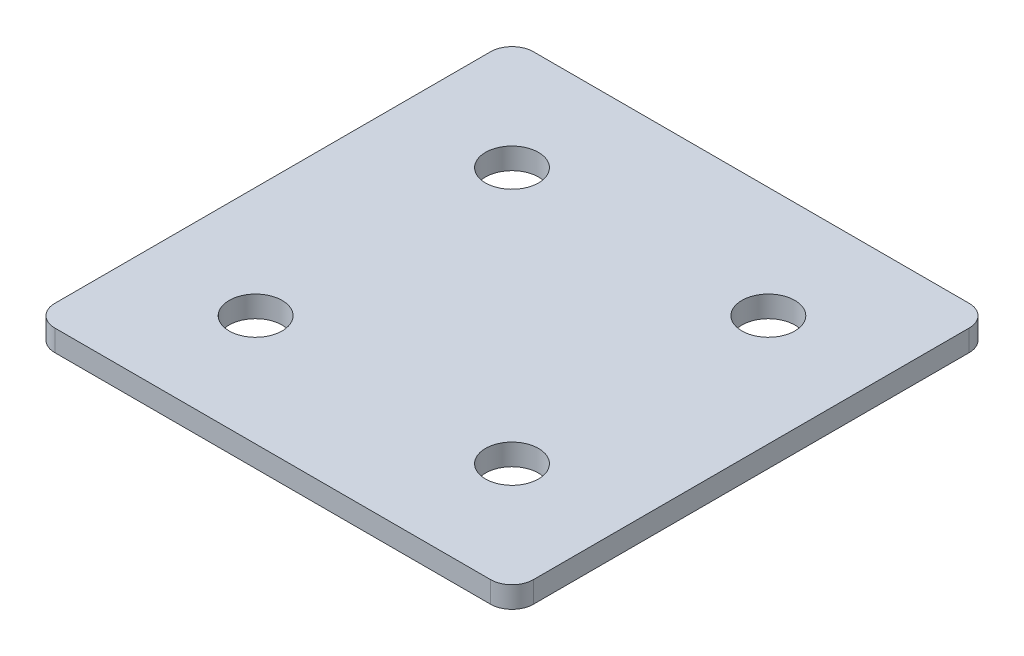
ISO-10303-21;
HEADER;
FILE_DESCRIPTION(('STEP AP214'),'2;1');
FILE_NAME('part.step','',(''),(''),'','','');
FILE_SCHEMA(('AUTOMOTIVE_DESIGN { 1 0 10303 214 1 1 1 1 }'));
ENDSEC;
DATA;
#1=APPLICATION_CONTEXT('core data for automotive mechanical design processes');
#2=APPLICATION_PROTOCOL_DEFINITION('international standard','automotive_design',2000,#1);
#3=PRODUCT_CONTEXT('',#1,'mechanical');
#4=PRODUCT('Part','Part','',(#3));
#5=PRODUCT_RELATED_PRODUCT_CATEGORY('part','',(#4));
#6=PRODUCT_DEFINITION_FORMATION('','',#4);
#7=PRODUCT_DEFINITION_CONTEXT('part definition',#1,'design');
#8=PRODUCT_DEFINITION('design','',#6,#7);
#9=PRODUCT_DEFINITION_SHAPE('','',#8);
#10=(LENGTH_UNIT() NAMED_UNIT(*) SI_UNIT(.MILLI.,.METRE.));
#11=(NAMED_UNIT(*) PLANE_ANGLE_UNIT() SI_UNIT($,.RADIAN.));
#12=(NAMED_UNIT(*) SI_UNIT($,.STERADIAN.) SOLID_ANGLE_UNIT());
#13=UNCERTAINTY_MEASURE_WITH_UNIT(LENGTH_MEASURE(1.E-05),#10,'distance_accuracy_value','');
#14=(GEOMETRIC_REPRESENTATION_CONTEXT(3) GLOBAL_UNCERTAINTY_ASSIGNED_CONTEXT((#13)) GLOBAL_UNIT_ASSIGNED_CONTEXT((#10,
#11,#12)) REPRESENTATION_CONTEXT('',''));
#15=CARTESIAN_POINT('',(0.,0.,0.));
#16=DIRECTION('',(0.,0.,1.));
#17=DIRECTION('',(1.,0.,0.));
#18=AXIS2_PLACEMENT_3D('',#15,#16,#17);
#19=CARTESIAN_POINT('',(-2.26192967289762,2.32454322778494,-16.3120326384523));
#20=DIRECTION('',(0.,-1.,0.));
#21=DIRECTION('',(0.,0.,-1.));
#22=AXIS2_PLACEMENT_3D('',#19,#20,#21);
#23=PLANE('',#22);
#24=CARTESIAN_POINT('',(12.7380703271024,2.32454322778494,13.6879673615477));
#25=DIRECTION('',(0.,1.,0.));
#26=DIRECTION('',(0.,0.,1.));
#27=AXIS2_PLACEMENT_3D('',#24,#25,#26);
#28=CIRCLE('',#27,3.1);
#29=CARTESIAN_POINT('',(12.7380703271024,2.32454322778494,16.7879673615477));
#30=VERTEX_POINT('',#29);
#31=EDGE_CURVE('E165',#30,#30,#28,.T.);
#32=ORIENTED_EDGE('',*,*,#31,.T.);
#33=EDGE_LOOP('',(#32));
#34=FACE_BOUND('',#33,.T.);
#35=CARTESIAN_POINT('',(-17.2619296728977,2.32454322778494,13.6879673615477));
#36=DIRECTION('',(0.,1.,0.));
#37=DIRECTION('',(0.,0.,1.));
#38=AXIS2_PLACEMENT_3D('',#35,#36,#37);
#39=CIRCLE('',#38,3.1);
#40=CARTESIAN_POINT('',(-17.2619296728977,2.32454322778494,16.7879673615477));
#41=VERTEX_POINT('',#40);
#42=EDGE_CURVE('E159',#41,#41,#39,.T.);
#43=ORIENTED_EDGE('',*,*,#42,.T.);
#44=EDGE_LOOP('',(#43));
#45=FACE_BOUND('',#44,.T.);
#46=CARTESIAN_POINT('',(12.7380703271024,2.32454322778494,-16.3120326384523));
#47=DIRECTION('',(0.,1.,0.));
#48=DIRECTION('',(0.,0.,1.));
#49=AXIS2_PLACEMENT_3D('',#46,#47,#48);
#50=CIRCLE('',#49,3.1);
#51=CARTESIAN_POINT('',(12.7380703271024,2.32454322778494,-13.2120326384523));
#52=VERTEX_POINT('',#51);
#53=EDGE_CURVE('E154',#52,#52,#50,.T.);
#54=ORIENTED_EDGE('',*,*,#53,.T.);
#55=EDGE_LOOP('',(#54));
#56=FACE_BOUND('',#55,.T.);
#57=CARTESIAN_POINT('',(-17.2619296728977,2.32454322778494,-16.3120326384523));
#58=DIRECTION('',(0.,1.,0.));
#59=DIRECTION('',(0.,0.,1.));
#60=AXIS2_PLACEMENT_3D('',#57,#58,#59);
#61=CIRCLE('',#60,3.1);
#62=CARTESIAN_POINT('',(-17.2619296728977,2.32454322778494,-13.2120326384523));
#63=VERTEX_POINT('',#62);
#64=EDGE_CURVE('E147',#63,#63,#61,.T.);
#65=ORIENTED_EDGE('',*,*,#64,.T.);
#66=EDGE_LOOP('',(#65));
#67=FACE_BOUND('',#66,.T.);
#68=DIRECTION('',(0.,0.,-1.));
#69=VECTOR('',#68,1.);
#70=CARTESIAN_POINT('',(25.7380703271025,2.32454322778494,26.6879673615476));
#71=LINE('',#70,#69);
#72=CARTESIAN_POINT('',(25.7380703271025,2.32454322778494,24.1879673615476));
#73=VERTEX_POINT('',#72);
#74=CARTESIAN_POINT('',(25.7380703271025,2.32454322778494,-26.8120326384524));
#75=VERTEX_POINT('',#74);
#76=EDGE_CURVE('E106',#73,#75,#71,.T.);
#77=ORIENTED_EDGE('',*,*,#76,.F.);
#78=CARTESIAN_POINT('',(23.2380703271025,2.32454322778494,24.1879673615476));
#79=DIRECTION('',(0.,-1.,0.));
#80=DIRECTION('',(0.,0.,-1.));
#81=AXIS2_PLACEMENT_3D('',#78,#79,#80);
#82=CIRCLE('',#81,2.5);
#83=CARTESIAN_POINT('',(23.2380703271025,2.32454322778494,26.6879673615476));
#84=VERTEX_POINT('',#83);
#85=EDGE_CURVE('E128',#73,#84,#82,.T.);
#86=ORIENTED_EDGE('',*,*,#85,.T.);
#87=DIRECTION('',(1.,0.,0.));
#88=VECTOR('',#87,1.);
#89=CARTESIAN_POINT('',(-30.2619296728977,2.32454322778494,26.6879673615476));
#90=LINE('',#89,#88);
#91=CARTESIAN_POINT('',(-27.7619296728977,2.32454322778494,26.6879673615476));
#92=VERTEX_POINT('',#91);
#93=EDGE_CURVE('E110',#92,#84,#90,.T.);
#94=ORIENTED_EDGE('',*,*,#93,.F.);
#95=CARTESIAN_POINT('',(-27.7619296728977,2.32454322778494,24.1879673615476));
#96=DIRECTION('',(0.,-1.,0.));
#97=DIRECTION('',(0.,0.,-1.));
#98=AXIS2_PLACEMENT_3D('',#95,#96,#97);
#99=CIRCLE('',#98,2.5);
#100=CARTESIAN_POINT('',(-30.2619296728977,2.32454322778494,24.1879673615476));
#101=VERTEX_POINT('',#100);
#102=EDGE_CURVE('E105',#92,#101,#99,.T.);
#103=ORIENTED_EDGE('',*,*,#102,.T.);
#104=DIRECTION('',(0.,0.,1.));
#105=VECTOR('',#104,1.);
#106=CARTESIAN_POINT('',(-30.2619296728977,2.32454322778494,-29.3120326384524));
#107=LINE('',#106,#105);
#108=CARTESIAN_POINT('',(-30.2619296728977,2.32454322778494,-26.8120326384524));
#109=VERTEX_POINT('',#108);
#110=EDGE_CURVE('E137',#109,#101,#107,.T.);
#111=ORIENTED_EDGE('',*,*,#110,.F.);
#112=CARTESIAN_POINT('',(-27.7619296728977,2.32454322778494,-26.8120326384524));
#113=DIRECTION('',(0.,-1.,0.));
#114=DIRECTION('',(0.,0.,-1.));
#115=AXIS2_PLACEMENT_3D('',#112,#113,#114);
#116=CIRCLE('',#115,2.5);
#117=CARTESIAN_POINT('',(-27.7619296728977,2.32454322778494,-29.3120326384524));
#118=VERTEX_POINT('',#117);
#119=EDGE_CURVE('E31',#109,#118,#116,.T.);
#120=ORIENTED_EDGE('',*,*,#119,.T.);
#121=DIRECTION('',(-1.,0.,0.));
#122=VECTOR('',#121,1.);
#123=CARTESIAN_POINT('',(25.7380703271025,2.32454322778494,-29.3120326384524));
#124=LINE('',#123,#122);
#125=CARTESIAN_POINT('',(23.2380703271025,2.32454322778494,-29.3120326384524));
#126=VERTEX_POINT('',#125);
#127=EDGE_CURVE('E138',#126,#118,#124,.T.);
#128=ORIENTED_EDGE('',*,*,#127,.F.);
#129=CARTESIAN_POINT('',(23.2380703271025,2.32454322778494,-26.8120326384524));
#130=DIRECTION('',(0.,-1.,0.));
#131=DIRECTION('',(0.,0.,-1.));
#132=AXIS2_PLACEMENT_3D('',#129,#130,#131);
#133=CIRCLE('',#132,2.5);
#134=EDGE_CURVE('E126',#126,#75,#133,.T.);
#135=ORIENTED_EDGE('',*,*,#134,.T.);
#136=EDGE_LOOP('',(#77,#86,#94,#103,#111,#120,#128,#135));
#137=FACE_BOUND('',#136,.T.);
#138=ADVANCED_FACE('F16',(#34,#45,#56,#67,#137),#23,.T.);
#139=CARTESIAN_POINT('',(25.7380703271025,2.32454322778494,-29.3120326384524));
#140=DIRECTION('',(0.,0.,-1.));
#141=DIRECTION('',(-1.,0.,0.));
#142=AXIS2_PLACEMENT_3D('',#139,#140,#141);
#143=PLANE('',#142);
#144=DIRECTION('',(-1.,0.,0.));
#145=VECTOR('',#144,1.);
#146=CARTESIAN_POINT('',(25.7380703271025,4.82454322778494,-29.3120326384524));
#147=LINE('',#146,#145);
#148=CARTESIAN_POINT('',(23.2380703271025,4.82454322778494,-29.3120326384524));
#149=VERTEX_POINT('',#148);
#150=CARTESIAN_POINT('',(-27.7619296728977,4.82454322778494,-29.3120326384524));
#151=VERTEX_POINT('',#150);
#152=EDGE_CURVE('E144',#149,#151,#147,.T.);
#153=ORIENTED_EDGE('',*,*,#152,.F.);
#154=DIRECTION('',(0.,1.,0.));
#155=VECTOR('',#154,1.);
#156=CARTESIAN_POINT('',(23.2380703271025,2.32454322778494,-29.3120326384524));
#157=LINE('',#156,#155);
#158=EDGE_CURVE('E38',#149,#126,#157,.F.);
#159=ORIENTED_EDGE('',*,*,#158,.T.);
#160=ORIENTED_EDGE('',*,*,#127,.T.);
#161=DIRECTION('',(0.,1.,0.));
#162=VECTOR('',#161,1.);
#163=CARTESIAN_POINT('',(-27.7619296728977,2.32454322778494,-29.3120326384524));
#164=LINE('',#163,#162);
#165=EDGE_CURVE('E130',#118,#151,#164,.T.);
#166=ORIENTED_EDGE('',*,*,#165,.T.);
#167=EDGE_LOOP('',(#153,#159,#160,#166));
#168=FACE_BOUND('',#167,.T.);
#169=ADVANCED_FACE('F206',(#168),#143,.T.);
#170=CARTESIAN_POINT('',(25.7380703271025,2.32454322778494,26.6879673615476));
#171=DIRECTION('',(1.,0.,0.));
#172=DIRECTION('',(0.,0.,-1.));
#173=AXIS2_PLACEMENT_3D('',#170,#171,#172);
#174=PLANE('',#173);
#175=DIRECTION('',(0.,0.,-1.));
#176=VECTOR('',#175,1.);
#177=CARTESIAN_POINT('',(25.7380703271025,4.82454322778494,26.6879673615476));
#178=LINE('',#177,#176);
#179=CARTESIAN_POINT('',(25.7380703271025,4.82454322778494,24.1879673615476));
#180=VERTEX_POINT('',#179);
#181=CARTESIAN_POINT('',(25.7380703271025,4.82454322778494,-26.8120326384524));
#182=VERTEX_POINT('',#181);
#183=EDGE_CURVE('E102',#180,#182,#178,.T.);
#184=ORIENTED_EDGE('',*,*,#183,.F.);
#185=DIRECTION('',(0.,1.,0.));
#186=VECTOR('',#185,1.);
#187=CARTESIAN_POINT('',(25.7380703271025,2.32454322778494,24.1879673615476));
#188=LINE('',#187,#186);
#189=EDGE_CURVE('E122',#180,#73,#188,.F.);
#190=ORIENTED_EDGE('',*,*,#189,.T.);
#191=ORIENTED_EDGE('',*,*,#76,.T.);
#192=DIRECTION('',(0.,1.,0.));
#193=VECTOR('',#192,1.);
#194=CARTESIAN_POINT('',(25.7380703271025,2.32454322778494,-26.8120326384524));
#195=LINE('',#194,#193);
#196=EDGE_CURVE('E119',#75,#182,#195,.T.);
#197=ORIENTED_EDGE('',*,*,#196,.T.);
#198=EDGE_LOOP('',(#184,#190,#191,#197));
#199=FACE_BOUND('',#198,.T.);
#200=ADVANCED_FACE('F211',(#199),#174,.T.);
#201=CARTESIAN_POINT('',(-30.2619296728977,2.32454322778494,26.6879673615476));
#202=DIRECTION('',(0.,0.,1.));
#203=DIRECTION('',(1.,0.,0.));
#204=AXIS2_PLACEMENT_3D('',#201,#202,#203);
#205=PLANE('',#204);
#206=ORIENTED_EDGE('',*,*,#93,.T.);
#207=DIRECTION('',(0.,1.,0.));
#208=VECTOR('',#207,1.);
#209=CARTESIAN_POINT('',(23.2380703271025,2.32454322778494,26.6879673615476));
#210=LINE('',#209,#208);
#211=CARTESIAN_POINT('',(23.2380703271025,4.82454322778494,26.6879673615476));
#212=VERTEX_POINT('',#211);
#213=EDGE_CURVE('E93',#84,#212,#210,.T.);
#214=ORIENTED_EDGE('',*,*,#213,.T.);
#215=DIRECTION('',(1.,0.,0.));
#216=VECTOR('',#215,1.);
#217=CARTESIAN_POINT('',(-30.2619296728977,4.82454322778494,26.6879673615476));
#218=LINE('',#217,#216);
#219=CARTESIAN_POINT('',(-27.7619296728977,4.82454322778494,26.6879673615476));
#220=VERTEX_POINT('',#219);
#221=EDGE_CURVE('E85',#220,#212,#218,.T.);
#222=ORIENTED_EDGE('',*,*,#221,.F.);
#223=DIRECTION('',(0.,1.,0.));
#224=VECTOR('',#223,1.);
#225=CARTESIAN_POINT('',(-27.7619296728977,2.32454322778494,26.6879673615476));
#226=LINE('',#225,#224);
#227=EDGE_CURVE('E99',#220,#92,#226,.F.);
#228=ORIENTED_EDGE('',*,*,#227,.T.);
#229=EDGE_LOOP('',(#206,#214,#222,#228));
#230=FACE_BOUND('',#229,.T.);
#231=ADVANCED_FACE('F98',(#230),#205,.T.);
#232=CARTESIAN_POINT('',(-30.2619296728977,2.32454322778494,-29.3120326384524));
#233=DIRECTION('',(-1.,0.,0.));
#234=DIRECTION('',(0.,0.,1.));
#235=AXIS2_PLACEMENT_3D('',#232,#233,#234);
#236=PLANE('',#235);
#237=DIRECTION('',(0.,0.,1.));
#238=VECTOR('',#237,1.);
#239=CARTESIAN_POINT('',(-30.2619296728977,4.82454322778494,-29.3120326384524));
#240=LINE('',#239,#238);
#241=CARTESIAN_POINT('',(-30.2619296728977,4.82454322778494,-26.8120326384524));
#242=VERTEX_POINT('',#241);
#243=CARTESIAN_POINT('',(-30.2619296728977,4.82454322778494,24.1879673615476));
#244=VERTEX_POINT('',#243);
#245=EDGE_CURVE('E87',#242,#244,#240,.T.);
#246=ORIENTED_EDGE('',*,*,#245,.F.);
#247=DIRECTION('',(0.,1.,0.));
#248=VECTOR('',#247,1.);
#249=CARTESIAN_POINT('',(-30.2619296728977,2.32454322778494,-26.8120326384524));
#250=LINE('',#249,#248);
#251=EDGE_CURVE('E10',#242,#109,#250,.F.);
#252=ORIENTED_EDGE('',*,*,#251,.T.);
#253=ORIENTED_EDGE('',*,*,#110,.T.);
#254=DIRECTION('',(0.,1.,0.));
#255=VECTOR('',#254,1.);
#256=CARTESIAN_POINT('',(-30.2619296728977,2.32454322778494,24.1879673615476));
#257=LINE('',#256,#255);
#258=EDGE_CURVE('E24',#101,#244,#257,.T.);
#259=ORIENTED_EDGE('',*,*,#258,.T.);
#260=EDGE_LOOP('',(#246,#252,#253,#259));
#261=FACE_BOUND('',#260,.T.);
#262=ADVANCED_FACE('F135',(#261),#236,.T.);
#263=CARTESIAN_POINT('',(-2.26192967289762,4.82454322778494,-16.3120326384523));
#264=DIRECTION('',(0.,-1.,0.));
#265=DIRECTION('',(0.,0.,-1.));
#266=AXIS2_PLACEMENT_3D('',#263,#264,#265);
#267=PLANE('',#266);
#268=CARTESIAN_POINT('',(12.7380703271024,4.82454322778494,13.6879673615477));
#269=DIRECTION('',(0.,1.,0.));
#270=DIRECTION('',(0.,0.,1.));
#271=AXIS2_PLACEMENT_3D('',#268,#269,#270);
#272=CIRCLE('',#271,3.1);
#273=CARTESIAN_POINT('',(12.7380703271024,4.82454322778494,16.7879673615477));
#274=VERTEX_POINT('',#273);
#275=EDGE_CURVE('E168',#274,#274,#272,.T.);
#276=ORIENTED_EDGE('',*,*,#275,.F.);
#277=EDGE_LOOP('',(#276));
#278=FACE_BOUND('',#277,.T.);
#279=CARTESIAN_POINT('',(-17.2619296728977,4.82454322778494,13.6879673615477));
#280=DIRECTION('',(0.,1.,0.));
#281=DIRECTION('',(0.,0.,1.));
#282=AXIS2_PLACEMENT_3D('',#279,#280,#281);
#283=CIRCLE('',#282,3.1);
#284=CARTESIAN_POINT('',(-17.2619296728977,4.82454322778494,16.7879673615477));
#285=VERTEX_POINT('',#284);
#286=EDGE_CURVE('E162',#285,#285,#283,.T.);
#287=ORIENTED_EDGE('',*,*,#286,.F.);
#288=EDGE_LOOP('',(#287));
#289=FACE_BOUND('',#288,.T.);
#290=CARTESIAN_POINT('',(12.7380703271024,4.82454322778494,-16.3120326384523));
#291=DIRECTION('',(0.,1.,0.));
#292=DIRECTION('',(0.,0.,1.));
#293=AXIS2_PLACEMENT_3D('',#290,#291,#292);
#294=CIRCLE('',#293,3.1);
#295=CARTESIAN_POINT('',(12.7380703271024,4.82454322778494,-13.2120326384523));
#296=VERTEX_POINT('',#295);
#297=EDGE_CURVE('E156',#296,#296,#294,.T.);
#298=ORIENTED_EDGE('',*,*,#297,.F.);
#299=EDGE_LOOP('',(#298));
#300=FACE_BOUND('',#299,.T.);
#301=CARTESIAN_POINT('',(-17.2619296728977,4.82454322778494,-16.3120326384523));
#302=DIRECTION('',(0.,1.,0.));
#303=DIRECTION('',(0.,0.,1.));
#304=AXIS2_PLACEMENT_3D('',#301,#302,#303);
#305=CIRCLE('',#304,3.1);
#306=CARTESIAN_POINT('',(-17.2619296728977,4.82454322778494,-13.2120326384523));
#307=VERTEX_POINT('',#306);
#308=EDGE_CURVE('E149',#307,#307,#305,.T.);
#309=ORIENTED_EDGE('',*,*,#308,.F.);
#310=EDGE_LOOP('',(#309));
#311=FACE_BOUND('',#310,.T.);
#312=ORIENTED_EDGE('',*,*,#221,.T.);
#313=CARTESIAN_POINT('',(23.2380703271025,4.82454322778494,24.1879673615476));
#314=DIRECTION('',(0.,-1.,0.));
#315=DIRECTION('',(0.,0.,-1.));
#316=AXIS2_PLACEMENT_3D('',#313,#314,#315);
#317=CIRCLE('',#316,2.5);
#318=EDGE_CURVE('E117',#212,#180,#317,.F.);
#319=ORIENTED_EDGE('',*,*,#318,.T.);
#320=ORIENTED_EDGE('',*,*,#183,.T.);
#321=CARTESIAN_POINT('',(23.2380703271025,4.82454322778494,-26.8120326384524));
#322=DIRECTION('',(0.,-1.,0.));
#323=DIRECTION('',(0.,0.,-1.));
#324=AXIS2_PLACEMENT_3D('',#321,#322,#323);
#325=CIRCLE('',#324,2.5);
#326=EDGE_CURVE('E115',#182,#149,#325,.F.);
#327=ORIENTED_EDGE('',*,*,#326,.T.);
#328=ORIENTED_EDGE('',*,*,#152,.T.);
#329=CARTESIAN_POINT('',(-27.7619296728977,4.82454322778494,-26.8120326384524));
#330=DIRECTION('',(0.,-1.,0.));
#331=DIRECTION('',(0.,0.,-1.));
#332=AXIS2_PLACEMENT_3D('',#329,#330,#331);
#333=CIRCLE('',#332,2.5);
#334=EDGE_CURVE('E92',#151,#242,#333,.F.);
#335=ORIENTED_EDGE('',*,*,#334,.T.);
#336=ORIENTED_EDGE('',*,*,#245,.T.);
#337=CARTESIAN_POINT('',(-27.7619296728977,4.82454322778494,24.1879673615476));
#338=DIRECTION('',(0.,-1.,0.));
#339=DIRECTION('',(0.,0.,-1.));
#340=AXIS2_PLACEMENT_3D('',#337,#338,#339);
#341=CIRCLE('',#340,2.5);
#342=EDGE_CURVE('E82',#244,#220,#341,.F.);
#343=ORIENTED_EDGE('',*,*,#342,.T.);
#344=EDGE_LOOP('',(#312,#319,#320,#327,#328,#335,#336,#343));
#345=FACE_BOUND('',#344,.T.);
#346=ADVANCED_FACE('F84',(#278,#289,#300,#311,#345),#267,.F.);
#347=CARTESIAN_POINT('',(-17.2619296728977,2.32454322778494,-16.3120326384523));
#348=DIRECTION('',(0.,1.,0.));
#349=DIRECTION('',(0.,0.,1.));
#350=AXIS2_PLACEMENT_3D('',#347,#348,#349);
#351=CYLINDRICAL_SURFACE('',#350,3.1);
#352=ORIENTED_EDGE('',*,*,#64,.F.);
#353=EDGE_LOOP('',(#352));
#354=FACE_BOUND('',#353,.T.);
#355=ORIENTED_EDGE('',*,*,#308,.T.);
#356=EDGE_LOOP('',(#355));
#357=FACE_BOUND('',#356,.T.);
#358=ADVANCED_FACE('F186',(#354,#357),#351,.F.);
#359=CARTESIAN_POINT('',(12.7380703271024,2.32454322778494,-16.3120326384523));
#360=DIRECTION('',(0.,1.,0.));
#361=DIRECTION('',(0.,0.,1.));
#362=AXIS2_PLACEMENT_3D('',#359,#360,#361);
#363=CYLINDRICAL_SURFACE('',#362,3.1);
#364=ORIENTED_EDGE('',*,*,#53,.F.);
#365=EDGE_LOOP('',(#364));
#366=FACE_BOUND('',#365,.T.);
#367=ORIENTED_EDGE('',*,*,#297,.T.);
#368=EDGE_LOOP('',(#367));
#369=FACE_BOUND('',#368,.T.);
#370=ADVANCED_FACE('F195',(#366,#369),#363,.F.);
#371=CARTESIAN_POINT('',(-17.2619296728977,2.32454322778494,13.6879673615477));
#372=DIRECTION('',(0.,1.,0.));
#373=DIRECTION('',(0.,0.,1.));
#374=AXIS2_PLACEMENT_3D('',#371,#372,#373);
#375=CYLINDRICAL_SURFACE('',#374,3.1);
#376=ORIENTED_EDGE('',*,*,#42,.F.);
#377=EDGE_LOOP('',(#376));
#378=FACE_BOUND('',#377,.T.);
#379=ORIENTED_EDGE('',*,*,#286,.T.);
#380=EDGE_LOOP('',(#379));
#381=FACE_BOUND('',#380,.T.);
#382=ADVANCED_FACE('F180',(#378,#381),#375,.F.);
#383=CARTESIAN_POINT('',(12.7380703271024,2.32454322778494,13.6879673615477));
#384=DIRECTION('',(0.,1.,0.));
#385=DIRECTION('',(0.,0.,1.));
#386=AXIS2_PLACEMENT_3D('',#383,#384,#385);
#387=CYLINDRICAL_SURFACE('',#386,3.1);
#388=ORIENTED_EDGE('',*,*,#31,.F.);
#389=EDGE_LOOP('',(#388));
#390=FACE_BOUND('',#389,.T.);
#391=ORIENTED_EDGE('',*,*,#275,.T.);
#392=EDGE_LOOP('',(#391));
#393=FACE_BOUND('',#392,.T.);
#394=ADVANCED_FACE('F176',(#390,#393),#387,.F.);
#395=CARTESIAN_POINT('',(23.2380703271025,2.32454322778494,24.1879673615476));
#396=DIRECTION('',(0.,1.,0.));
#397=DIRECTION('',(0.,0.,1.));
#398=AXIS2_PLACEMENT_3D('',#395,#396,#397);
#399=CYLINDRICAL_SURFACE('',#398,2.5);
#400=ORIENTED_EDGE('',*,*,#85,.F.);
#401=ORIENTED_EDGE('',*,*,#189,.F.);
#402=ORIENTED_EDGE('',*,*,#318,.F.);
#403=ORIENTED_EDGE('',*,*,#213,.F.);
#404=EDGE_LOOP('',(#400,#401,#402,#403));
#405=FACE_BOUND('',#404,.T.);
#406=ADVANCED_FACE('F179',(#405),#399,.T.);
#407=CARTESIAN_POINT('',(23.2380703271025,2.32454322778494,-26.8120326384524));
#408=DIRECTION('',(0.,1.,0.));
#409=DIRECTION('',(0.,0.,1.));
#410=AXIS2_PLACEMENT_3D('',#407,#408,#409);
#411=CYLINDRICAL_SURFACE('',#410,2.5);
#412=ORIENTED_EDGE('',*,*,#134,.F.);
#413=ORIENTED_EDGE('',*,*,#158,.F.);
#414=ORIENTED_EDGE('',*,*,#326,.F.);
#415=ORIENTED_EDGE('',*,*,#196,.F.);
#416=EDGE_LOOP('',(#412,#413,#414,#415));
#417=FACE_BOUND('',#416,.T.);
#418=ADVANCED_FACE('F216',(#417),#411,.T.);
#419=CARTESIAN_POINT('',(-27.7619296728977,2.32454322778494,-26.8120326384524));
#420=DIRECTION('',(0.,1.,0.));
#421=DIRECTION('',(0.,0.,1.));
#422=AXIS2_PLACEMENT_3D('',#419,#420,#421);
#423=CYLINDRICAL_SURFACE('',#422,2.5);
#424=ORIENTED_EDGE('',*,*,#119,.F.);
#425=ORIENTED_EDGE('',*,*,#251,.F.);
#426=ORIENTED_EDGE('',*,*,#334,.F.);
#427=ORIENTED_EDGE('',*,*,#165,.F.);
#428=EDGE_LOOP('',(#424,#425,#426,#427));
#429=FACE_BOUND('',#428,.T.);
#430=ADVANCED_FACE('F219',(#429),#423,.T.);
#431=CARTESIAN_POINT('',(-27.7619296728977,2.32454322778494,24.1879673615476));
#432=DIRECTION('',(0.,1.,0.));
#433=DIRECTION('',(0.,0.,1.));
#434=AXIS2_PLACEMENT_3D('',#431,#432,#433);
#435=CYLINDRICAL_SURFACE('',#434,2.5);
#436=ORIENTED_EDGE('',*,*,#102,.F.);
#437=ORIENTED_EDGE('',*,*,#227,.F.);
#438=ORIENTED_EDGE('',*,*,#342,.F.);
#439=ORIENTED_EDGE('',*,*,#258,.F.);
#440=EDGE_LOOP('',(#436,#437,#438,#439));
#441=FACE_BOUND('',#440,.T.);
#442=ADVANCED_FACE('F18',(#441),#435,.T.);
#443=CLOSED_SHELL('',(#138,#169,#200,#231,#262,#346,#358,#370,#382,#394,#406,#418,#430,#442));
#444=MANIFOLD_SOLID_BREP('B1',#443);
#445=ADVANCED_BREP_SHAPE_REPRESENTATION('',(#18,#444),#14);
#446=SHAPE_DEFINITION_REPRESENTATION(#9,#445);
ENDSEC;
END-ISO-10303-21;
